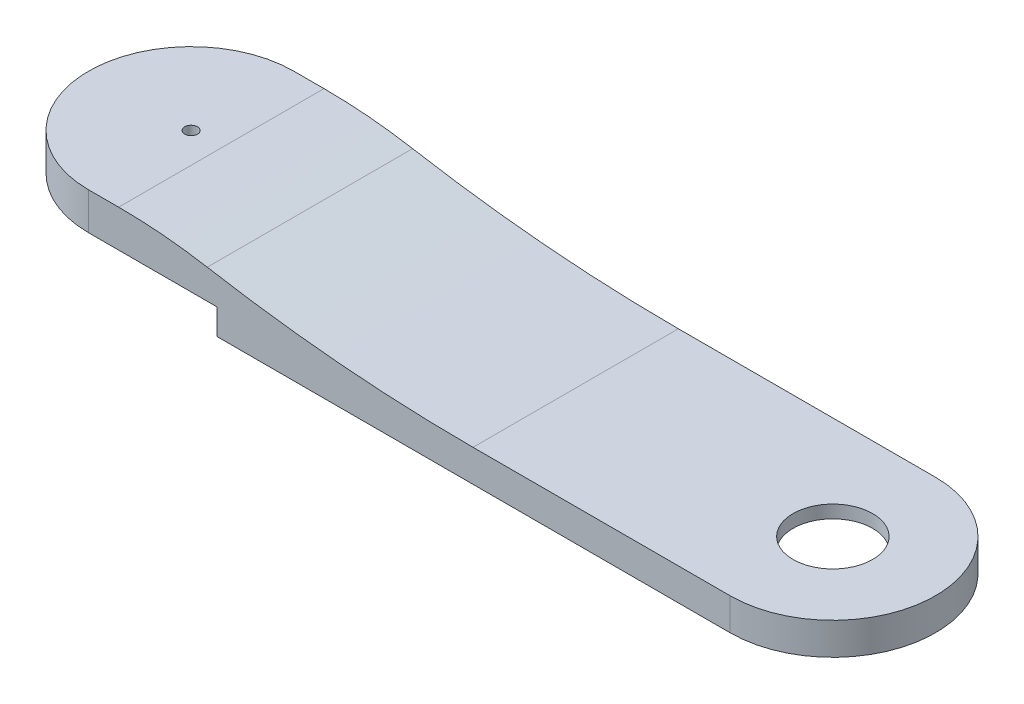
ISO-10303-21;
HEADER;
FILE_DESCRIPTION(('STEP AP214'),'2;1');
FILE_NAME('part.step','',(''),(''),'','','');
FILE_SCHEMA(('AUTOMOTIVE_DESIGN { 1 0 10303 214 1 1 1 1 }'));
ENDSEC;
DATA;
#1=APPLICATION_CONTEXT('core data for automotive mechanical design processes');
#2=APPLICATION_PROTOCOL_DEFINITION('international standard','automotive_design',2000,#1);
#3=PRODUCT_CONTEXT('',#1,'mechanical');
#4=PRODUCT('Part','Part','',(#3));
#5=PRODUCT_RELATED_PRODUCT_CATEGORY('part','',(#4));
#6=PRODUCT_DEFINITION_FORMATION('','',#4);
#7=PRODUCT_DEFINITION_CONTEXT('part definition',#1,'design');
#8=PRODUCT_DEFINITION('design','',#6,#7);
#9=PRODUCT_DEFINITION_SHAPE('','',#8);
#10=(LENGTH_UNIT() NAMED_UNIT(*) SI_UNIT(.MILLI.,.METRE.));
#11=(NAMED_UNIT(*) PLANE_ANGLE_UNIT() SI_UNIT($,.RADIAN.));
#12=(NAMED_UNIT(*) SI_UNIT($,.STERADIAN.) SOLID_ANGLE_UNIT());
#13=UNCERTAINTY_MEASURE_WITH_UNIT(LENGTH_MEASURE(1.E-05),#10,'distance_accuracy_value','');
#14=(GEOMETRIC_REPRESENTATION_CONTEXT(3) GLOBAL_UNCERTAINTY_ASSIGNED_CONTEXT((#13)) GLOBAL_UNIT_ASSIGNED_CONTEXT((#10,
#11,#12)) REPRESENTATION_CONTEXT('',''));
#15=CARTESIAN_POINT('',(0.,0.,0.));
#16=DIRECTION('',(0.,0.,1.));
#17=DIRECTION('',(1.,0.,0.));
#18=AXIS2_PLACEMENT_3D('',#15,#16,#17);
#19=CARTESIAN_POINT('',(50.,0.,0.));
#20=DIRECTION('',(-1.,0.,0.));
#21=DIRECTION('',(0.,0.,1.));
#22=AXIS2_PLACEMENT_3D('',#19,#20,#21);
#23=PLANE('',#22);
#24=DIRECTION('',(0.,-1.,0.));
#25=VECTOR('',#24,1.);
#26=CARTESIAN_POINT('',(50.,19.5,-29.));
#27=LINE('',#26,#25);
#28=CARTESIAN_POINT('',(50.,19.5,-29.));
#29=VERTEX_POINT('',#28);
#30=CARTESIAN_POINT('',(50.,10.,-29.));
#31=VERTEX_POINT('',#30);
#32=EDGE_CURVE('E221',#29,#31,#27,.T.);
#33=ORIENTED_EDGE('',*,*,#32,.T.);
#34=DIRECTION('',(0.,0.,1.));
#35=VECTOR('',#34,1.);
#36=CARTESIAN_POINT('',(50.,10.,-40.));
#37=LINE('',#36,#35);
#38=CARTESIAN_POINT('',(50.,10.,-40.));
#39=VERTEX_POINT('',#38);
#40=EDGE_CURVE('E173',#39,#31,#37,.T.);
#41=ORIENTED_EDGE('',*,*,#40,.F.);
#42=DIRECTION('',(0.,1.,0.));
#43=VECTOR('',#42,1.);
#44=CARTESIAN_POINT('',(50.,0.,-40.));
#45=LINE('',#44,#43);
#46=CARTESIAN_POINT('',(50.,0.,-40.));
#47=VERTEX_POINT('',#46);
#48=EDGE_CURVE('E170',#47,#39,#45,.T.);
#49=ORIENTED_EDGE('',*,*,#48,.F.);
#50=DIRECTION('',(0.,0.,1.));
#51=VECTOR('',#50,1.);
#52=CARTESIAN_POINT('',(50.,0.,0.));
#53=LINE('',#52,#51);
#54=CARTESIAN_POINT('',(50.,0.,-29.));
#55=VERTEX_POINT('',#54);
#56=EDGE_CURVE('E240',#47,#55,#53,.T.);
#57=ORIENTED_EDGE('',*,*,#56,.T.);
#58=DIRECTION('',(0.,-1.,0.));
#59=VECTOR('',#58,1.);
#60=CARTESIAN_POINT('',(50.,7.5,-29.));
#61=LINE('',#60,#59);
#62=CARTESIAN_POINT('',(50.,7.5,-29.));
#63=VERTEX_POINT('',#62);
#64=EDGE_CURVE('E282',#63,#55,#61,.T.);
#65=ORIENTED_EDGE('',*,*,#64,.F.);
#66=DIRECTION('',(0.,0.,1.));
#67=VECTOR('',#66,1.);
#68=CARTESIAN_POINT('',(50.,7.5,0.));
#69=LINE('',#68,#67);
#70=CARTESIAN_POINT('',(50.,7.5,29.));
#71=VERTEX_POINT('',#70);
#72=EDGE_CURVE('E231',#63,#71,#69,.T.);
#73=ORIENTED_EDGE('',*,*,#72,.T.);
#74=DIRECTION('',(0.,1.,0.));
#75=VECTOR('',#74,1.);
#76=CARTESIAN_POINT('',(50.,7.5,29.));
#77=LINE('',#76,#75);
#78=CARTESIAN_POINT('',(50.,0.,29.));
#79=VERTEX_POINT('',#78);
#80=EDGE_CURVE('E244',#79,#71,#77,.T.);
#81=ORIENTED_EDGE('',*,*,#80,.F.);
#82=CARTESIAN_POINT('',(50.,0.,40.));
#83=VERTEX_POINT('',#82);
#84=EDGE_CURVE('E237',#79,#83,#53,.T.);
#85=ORIENTED_EDGE('',*,*,#84,.T.);
#86=DIRECTION('',(0.,1.,0.));
#87=VECTOR('',#86,1.);
#88=CARTESIAN_POINT('',(50.,0.,40.));
#89=LINE('',#88,#87);
#90=CARTESIAN_POINT('',(50.,10.,40.));
#91=VERTEX_POINT('',#90);
#92=EDGE_CURVE('E242',#83,#91,#89,.T.);
#93=ORIENTED_EDGE('',*,*,#92,.T.);
#94=DIRECTION('',(0.,0.,1.));
#95=VECTOR('',#94,1.);
#96=CARTESIAN_POINT('',(50.,10.,29.));
#97=LINE('',#96,#95);
#98=CARTESIAN_POINT('',(50.,10.,29.));
#99=VERTEX_POINT('',#98);
#100=EDGE_CURVE('E197',#99,#91,#97,.T.);
#101=ORIENTED_EDGE('',*,*,#100,.F.);
#102=DIRECTION('',(0.,-1.,0.));
#103=VECTOR('',#102,1.);
#104=CARTESIAN_POINT('',(50.,19.5,29.));
#105=LINE('',#104,#103);
#106=CARTESIAN_POINT('',(50.,19.5,29.));
#107=VERTEX_POINT('',#106);
#108=EDGE_CURVE('E219',#107,#99,#105,.T.);
#109=ORIENTED_EDGE('',*,*,#108,.F.);
#110=DIRECTION('',(0.,0.,1.));
#111=VECTOR('',#110,1.);
#112=CARTESIAN_POINT('',(50.,19.5,0.));
#113=LINE('',#112,#111);
#114=EDGE_CURVE('E208',#29,#107,#113,.T.);
#115=ORIENTED_EDGE('',*,*,#114,.F.);
#116=EDGE_LOOP('',(#33,#41,#49,#57,#65,#73,#81,#85,#93,#101,#109,#115));
#117=FACE_BOUND('',#116,.T.);
#118=ADVANCED_FACE('F35',(#117),#23,.T.);
#119=CARTESIAN_POINT('',(0.,12.5,0.));
#120=DIRECTION('',(0.,1.,0.));
#121=DIRECTION('',(0.,0.,1.));
#122=AXIS2_PLACEMENT_3D('',#119,#120,#121);
#123=PLANE('',#122);
#124=CARTESIAN_POINT('',(250.,12.5,0.));
#125=DIRECTION('',(0.,-1.,0.));
#126=DIRECTION('',(0.,0.,-1.));
#127=AXIS2_PLACEMENT_3D('',#124,#125,#126);
#128=CIRCLE('',#127,15.5);
#129=CARTESIAN_POINT('',(250.,12.5,-15.5));
#130=VERTEX_POINT('',#129);
#131=EDGE_CURVE('E223',#130,#130,#128,.T.);
#132=ORIENTED_EDGE('',*,*,#131,.T.);
#133=EDGE_LOOP('',(#132));
#134=FACE_BOUND('',#133,.T.);
#135=DIRECTION('',(-1.,0.,0.));
#136=VECTOR('',#135,1.);
#137=CARTESIAN_POINT('',(0.,12.5,-40.));
#138=LINE('',#137,#136);
#139=CARTESIAN_POINT('',(250.,12.5,-40.));
#140=VERTEX_POINT('',#139);
#141=CARTESIAN_POINT('',(149.808582976972,12.5,-40.));
#142=VERTEX_POINT('',#141);
#143=EDGE_CURVE('E234',#140,#142,#138,.T.);
#144=ORIENTED_EDGE('',*,*,#143,.T.);
#145=DIRECTION('',(0.,0.,-1.));
#146=VECTOR('',#145,1.);
#147=CARTESIAN_POINT('',(149.808582976972,12.5,40.));
#148=LINE('',#147,#146);
#149=CARTESIAN_POINT('',(149.808582976972,12.5,40.));
#150=VERTEX_POINT('',#149);
#151=EDGE_CURVE('E294',#142,#150,#148,.F.);
#152=ORIENTED_EDGE('',*,*,#151,.T.);
#153=DIRECTION('',(1.,0.,0.));
#154=VECTOR('',#153,1.);
#155=CARTESIAN_POINT('',(0.,12.5,40.));
#156=LINE('',#155,#154);
#157=CARTESIAN_POINT('',(250.,12.5,40.));
#158=VERTEX_POINT('',#157);
#159=EDGE_CURVE('E228',#150,#158,#156,.T.);
#160=ORIENTED_EDGE('',*,*,#159,.T.);
#161=CARTESIAN_POINT('',(250.,12.5,0.));
#162=DIRECTION('',(0.,1.,0.));
#163=DIRECTION('',(0.,0.,1.));
#164=AXIS2_PLACEMENT_3D('',#161,#162,#163);
#165=CIRCLE('',#164,40.);
#166=EDGE_CURVE('E230',#158,#140,#165,.T.);
#167=ORIENTED_EDGE('',*,*,#166,.T.);
#168=EDGE_LOOP('',(#144,#152,#160,#167));
#169=FACE_BOUND('',#168,.T.);
#170=ADVANCED_FACE('F299',(#134,#169),#123,.T.);
#171=CARTESIAN_POINT('',(0.,0.,0.));
#172=DIRECTION('',(0.,1.,0.));
#173=DIRECTION('',(0.,0.,1.));
#174=AXIS2_PLACEMENT_3D('',#171,#172,#173);
#175=PLANE('',#174);
#176=ORIENTED_EDGE('',*,*,#56,.F.);
#177=DIRECTION('',(-1.,0.,0.));
#178=VECTOR('',#177,1.);
#179=CARTESIAN_POINT('',(0.,0.,-40.));
#180=LINE('',#179,#178);
#181=CARTESIAN_POINT('',(250.,0.,-40.));
#182=VERTEX_POINT('',#181);
#183=EDGE_CURVE('E274',#182,#47,#180,.T.);
#184=ORIENTED_EDGE('',*,*,#183,.F.);
#185=CARTESIAN_POINT('',(250.,0.,0.));
#186=DIRECTION('',(0.,1.,0.));
#187=DIRECTION('',(0.,0.,1.));
#188=AXIS2_PLACEMENT_3D('',#185,#186,#187);
#189=CIRCLE('',#188,40.);
#190=CARTESIAN_POINT('',(250.,0.,40.));
#191=VERTEX_POINT('',#190);
#192=EDGE_CURVE('E272',#191,#182,#189,.T.);
#193=ORIENTED_EDGE('',*,*,#192,.F.);
#194=DIRECTION('',(1.,0.,0.));
#195=VECTOR('',#194,1.);
#196=CARTESIAN_POINT('',(0.,0.,40.));
#197=LINE('',#196,#195);
#198=EDGE_CURVE('E270',#83,#191,#197,.T.);
#199=ORIENTED_EDGE('',*,*,#198,.F.);
#200=ORIENTED_EDGE('',*,*,#84,.F.);
#201=DIRECTION('',(1.,0.,0.));
#202=VECTOR('',#201,1.);
#203=CARTESIAN_POINT('',(0.,0.,29.));
#204=LINE('',#203,#202);
#205=CARTESIAN_POINT('',(250.,0.,29.));
#206=VERTEX_POINT('',#205);
#207=EDGE_CURVE('E248',#79,#206,#204,.T.);
#208=ORIENTED_EDGE('',*,*,#207,.T.);
#209=CARTESIAN_POINT('',(250.,0.,0.));
#210=DIRECTION('',(0.,1.,0.));
#211=DIRECTION('',(0.,0.,1.));
#212=AXIS2_PLACEMENT_3D('',#209,#210,#211);
#213=CIRCLE('',#212,29.);
#214=CARTESIAN_POINT('',(250.,0.,-29.));
#215=VERTEX_POINT('',#214);
#216=EDGE_CURVE('E261',#206,#215,#213,.T.);
#217=ORIENTED_EDGE('',*,*,#216,.T.);
#218=DIRECTION('',(-1.,0.,0.));
#219=VECTOR('',#218,1.);
#220=CARTESIAN_POINT('',(0.,0.,-29.));
#221=LINE('',#220,#219);
#222=EDGE_CURVE('E253',#215,#55,#221,.T.);
#223=ORIENTED_EDGE('',*,*,#222,.T.);
#224=EDGE_LOOP('',(#176,#184,#193,#199,#200,#208,#217,#223));
#225=FACE_BOUND('',#224,.T.);
#226=ADVANCED_FACE('F324',(#225),#175,.F.);
#227=CARTESIAN_POINT('',(0.,7.5,40.));
#228=DIRECTION('',(0.,0.,-1.));
#229=DIRECTION('',(-1.,0.,0.));
#230=AXIS2_PLACEMENT_3D('',#227,#228,#229);
#231=PLANE('',#230);
#232=ORIENTED_EDGE('',*,*,#159,.F.);
#233=CARTESIAN_POINT('',(149.808582976972,612.5,40.));
#234=DIRECTION('',(0.,0.,-1.));
#235=DIRECTION('',(-1.,0.,0.));
#236=AXIS2_PLACEMENT_3D('',#233,#234,#235);
#237=CIRCLE('',#236,600.);
#238=CARTESIAN_POINT('',(46.275979416547,21.5,40.));
#239=VERTEX_POINT('',#238);
#240=EDGE_CURVE('E43',#150,#239,#237,.T.);
#241=ORIENTED_EDGE('',*,*,#240,.T.);
#242=CARTESIAN_POINT('',(11.7651115630721,-175.5,40.));
#243=DIRECTION('',(0.,0.,-1.));
#244=DIRECTION('',(-1.,0.,0.));
#245=AXIS2_PLACEMENT_3D('',#242,#243,#244);
#246=CIRCLE('',#245,200.);
#247=CARTESIAN_POINT('',(11.7651115630721,24.5,40.));
#248=VERTEX_POINT('',#247);
#249=EDGE_CURVE('E292',#239,#248,#246,.F.);
#250=ORIENTED_EDGE('',*,*,#249,.T.);
#251=DIRECTION('',(1.,0.,0.));
#252=VECTOR('',#251,1.);
#253=CARTESIAN_POINT('',(0.,24.5,40.));
#254=LINE('',#253,#252);
#255=CARTESIAN_POINT('',(0.,24.5,40.));
#256=VERTEX_POINT('',#255);
#257=EDGE_CURVE('E200',#256,#248,#254,.T.);
#258=ORIENTED_EDGE('',*,*,#257,.F.);
#259=DIRECTION('',(0.,-1.,0.));
#260=VECTOR('',#259,1.);
#261=CARTESIAN_POINT('',(0.,19.5,40.));
#262=LINE('',#261,#260);
#263=CARTESIAN_POINT('',(0.,10.,40.));
#264=VERTEX_POINT('',#263);
#265=EDGE_CURVE('E163',#256,#264,#262,.T.);
#266=ORIENTED_EDGE('',*,*,#265,.T.);
#267=DIRECTION('',(-1.,0.,0.));
#268=VECTOR('',#267,1.);
#269=CARTESIAN_POINT('',(50.,10.,40.));
#270=LINE('',#269,#268);
#271=EDGE_CURVE('E179',#91,#264,#270,.T.);
#272=ORIENTED_EDGE('',*,*,#271,.F.);
#273=ORIENTED_EDGE('',*,*,#92,.F.);
#274=ORIENTED_EDGE('',*,*,#198,.T.);
#275=DIRECTION('',(0.,-1.,0.));
#276=VECTOR('',#275,1.);
#277=CARTESIAN_POINT('',(250.,7.5,40.));
#278=LINE('',#277,#276);
#279=EDGE_CURVE('E279',#158,#191,#278,.T.);
#280=ORIENTED_EDGE('',*,*,#279,.F.);
#281=EDGE_LOOP('',(#232,#241,#250,#258,#266,#272,#273,#274,#280));
#282=FACE_BOUND('',#281,.T.);
#283=ADVANCED_FACE('F304',(#282),#231,.F.);
#284=CARTESIAN_POINT('',(0.,7.5,-40.));
#285=DIRECTION('',(0.,0.,1.));
#286=DIRECTION('',(1.,0.,0.));
#287=AXIS2_PLACEMENT_3D('',#284,#285,#286);
#288=PLANE('',#287);
#289=DIRECTION('',(-1.,0.,0.));
#290=VECTOR('',#289,1.);
#291=CARTESIAN_POINT('',(80.,24.5,-40.));
#292=LINE('',#291,#290);
#293=CARTESIAN_POINT('',(11.7651115630721,24.5,-40.));
#294=VERTEX_POINT('',#293);
#295=CARTESIAN_POINT('',(0.,24.5,-40.));
#296=VERTEX_POINT('',#295);
#297=EDGE_CURVE('E203',#294,#296,#292,.T.);
#298=ORIENTED_EDGE('',*,*,#297,.F.);
#299=CARTESIAN_POINT('',(11.7651115630721,-175.5,-40.));
#300=DIRECTION('',(0.,0.,1.));
#301=DIRECTION('',(1.,0.,0.));
#302=AXIS2_PLACEMENT_3D('',#299,#300,#301);
#303=CIRCLE('',#302,200.);
#304=CARTESIAN_POINT('',(46.275979416547,21.5,-40.));
#305=VERTEX_POINT('',#304);
#306=EDGE_CURVE('E290',#294,#305,#303,.F.);
#307=ORIENTED_EDGE('',*,*,#306,.T.);
#308=CARTESIAN_POINT('',(149.808582976972,612.5,-40.));
#309=DIRECTION('',(0.,0.,1.));
#310=DIRECTION('',(1.,0.,0.));
#311=AXIS2_PLACEMENT_3D('',#308,#309,#310);
#312=CIRCLE('',#311,600.);
#313=EDGE_CURVE('E11',#305,#142,#312,.T.);
#314=ORIENTED_EDGE('',*,*,#313,.T.);
#315=ORIENTED_EDGE('',*,*,#143,.F.);
#316=DIRECTION('',(0.,-1.,0.));
#317=VECTOR('',#316,1.);
#318=CARTESIAN_POINT('',(250.,7.5,-40.));
#319=LINE('',#318,#317);
#320=EDGE_CURVE('E276',#140,#182,#319,.T.);
#321=ORIENTED_EDGE('',*,*,#320,.T.);
#322=ORIENTED_EDGE('',*,*,#183,.T.);
#323=ORIENTED_EDGE('',*,*,#48,.T.);
#324=DIRECTION('',(1.,0.,0.));
#325=VECTOR('',#324,1.);
#326=CARTESIAN_POINT('',(0.,10.,-40.));
#327=LINE('',#326,#325);
#328=CARTESIAN_POINT('',(0.,10.,-40.));
#329=VERTEX_POINT('',#328);
#330=EDGE_CURVE('E167',#329,#39,#327,.T.);
#331=ORIENTED_EDGE('',*,*,#330,.F.);
#332=DIRECTION('',(0.,-1.,0.));
#333=VECTOR('',#332,1.);
#334=CARTESIAN_POINT('',(0.,19.5,-40.));
#335=LINE('',#334,#333);
#336=EDGE_CURVE('E153',#296,#329,#335,.T.);
#337=ORIENTED_EDGE('',*,*,#336,.F.);
#338=EDGE_LOOP('',(#298,#307,#314,#315,#321,#322,#323,#331,#337));
#339=FACE_BOUND('',#338,.T.);
#340=ADVANCED_FACE('F168',(#339),#288,.F.);
#341=CARTESIAN_POINT('',(0.,7.5,29.));
#342=DIRECTION('',(0.,0.,-1.));
#343=DIRECTION('',(-1.,0.,0.));
#344=AXIS2_PLACEMENT_3D('',#341,#342,#343);
#345=PLANE('',#344);
#346=ORIENTED_EDGE('',*,*,#207,.F.);
#347=ORIENTED_EDGE('',*,*,#80,.T.);
#348=DIRECTION('',(1.,0.,0.));
#349=VECTOR('',#348,1.);
#350=CARTESIAN_POINT('',(0.,7.5,29.));
#351=LINE('',#350,#349);
#352=CARTESIAN_POINT('',(250.,7.5,29.));
#353=VERTEX_POINT('',#352);
#354=EDGE_CURVE('E249',#71,#353,#351,.T.);
#355=ORIENTED_EDGE('',*,*,#354,.T.);
#356=DIRECTION('',(0.,-1.,0.));
#357=VECTOR('',#356,1.);
#358=CARTESIAN_POINT('',(250.,7.5,29.));
#359=LINE('',#358,#357);
#360=EDGE_CURVE('E267',#353,#206,#359,.T.);
#361=ORIENTED_EDGE('',*,*,#360,.T.);
#362=EDGE_LOOP('',(#346,#347,#355,#361));
#363=FACE_BOUND('',#362,.T.);
#364=ADVANCED_FACE('F333',(#363),#345,.T.);
#365=CARTESIAN_POINT('',(0.,7.5,-29.));
#366=DIRECTION('',(0.,0.,1.));
#367=DIRECTION('',(1.,0.,0.));
#368=AXIS2_PLACEMENT_3D('',#365,#366,#367);
#369=PLANE('',#368);
#370=DIRECTION('',(-1.,0.,0.));
#371=VECTOR('',#370,1.);
#372=CARTESIAN_POINT('',(0.,7.5,-29.));
#373=LINE('',#372,#371);
#374=CARTESIAN_POINT('',(250.,7.5,-29.));
#375=VERTEX_POINT('',#374);
#376=EDGE_CURVE('E256',#375,#63,#373,.T.);
#377=ORIENTED_EDGE('',*,*,#376,.T.);
#378=ORIENTED_EDGE('',*,*,#64,.T.);
#379=ORIENTED_EDGE('',*,*,#222,.F.);
#380=DIRECTION('',(0.,-1.,0.));
#381=VECTOR('',#380,1.);
#382=CARTESIAN_POINT('',(250.,7.5,-29.));
#383=LINE('',#382,#381);
#384=EDGE_CURVE('E259',#375,#215,#383,.T.);
#385=ORIENTED_EDGE('',*,*,#384,.F.);
#386=EDGE_LOOP('',(#377,#378,#379,#385));
#387=FACE_BOUND('',#386,.T.);
#388=ADVANCED_FACE('F330',(#387),#369,.T.);
#389=CARTESIAN_POINT('',(250.,7.5,0.));
#390=DIRECTION('',(0.,-1.,0.));
#391=DIRECTION('',(0.,0.,-1.));
#392=AXIS2_PLACEMENT_3D('',#389,#390,#391);
#393=CYLINDRICAL_SURFACE('',#392,40.);
#394=ORIENTED_EDGE('',*,*,#192,.T.);
#395=ORIENTED_EDGE('',*,*,#320,.F.);
#396=ORIENTED_EDGE('',*,*,#166,.F.);
#397=ORIENTED_EDGE('',*,*,#279,.T.);
#398=EDGE_LOOP('',(#394,#395,#396,#397));
#399=FACE_BOUND('',#398,.T.);
#400=ADVANCED_FACE('F310',(#399),#393,.T.);
#401=CARTESIAN_POINT('',(250.,7.5,0.));
#402=DIRECTION('',(0.,-1.,0.));
#403=DIRECTION('',(0.,0.,-1.));
#404=AXIS2_PLACEMENT_3D('',#401,#402,#403);
#405=CYLINDRICAL_SURFACE('',#404,29.);
#406=ORIENTED_EDGE('',*,*,#216,.F.);
#407=ORIENTED_EDGE('',*,*,#360,.F.);
#408=CARTESIAN_POINT('',(250.,7.5,0.));
#409=DIRECTION('',(0.,1.,0.));
#410=DIRECTION('',(0.,0.,1.));
#411=AXIS2_PLACEMENT_3D('',#408,#409,#410);
#412=CIRCLE('',#411,29.);
#413=EDGE_CURVE('E252',#353,#375,#412,.T.);
#414=ORIENTED_EDGE('',*,*,#413,.T.);
#415=ORIENTED_EDGE('',*,*,#384,.T.);
#416=EDGE_LOOP('',(#406,#407,#414,#415));
#417=FACE_BOUND('',#416,.T.);
#418=ADVANCED_FACE('F335',(#417),#405,.F.);
#419=CARTESIAN_POINT('',(0.,7.5,0.));
#420=DIRECTION('',(0.,1.,0.));
#421=DIRECTION('',(0.,0.,1.));
#422=AXIS2_PLACEMENT_3D('',#419,#420,#421);
#423=PLANE('',#422);
#424=CARTESIAN_POINT('',(250.,7.5,0.));
#425=DIRECTION('',(0.,1.,0.));
#426=DIRECTION('',(0.,0.,1.));
#427=AXIS2_PLACEMENT_3D('',#424,#425,#426);
#428=CIRCLE('',#427,15.5);
#429=CARTESIAN_POINT('',(250.,7.5,15.5));
#430=VERTEX_POINT('',#429);
#431=EDGE_CURVE('E227',#430,#430,#428,.T.);
#432=ORIENTED_EDGE('',*,*,#431,.T.);
#433=EDGE_LOOP('',(#432));
#434=FACE_BOUND('',#433,.T.);
#435=ORIENTED_EDGE('',*,*,#376,.F.);
#436=ORIENTED_EDGE('',*,*,#413,.F.);
#437=ORIENTED_EDGE('',*,*,#354,.F.);
#438=ORIENTED_EDGE('',*,*,#72,.F.);
#439=EDGE_LOOP('',(#435,#436,#437,#438));
#440=FACE_BOUND('',#439,.T.);
#441=ADVANCED_FACE('F329',(#434,#440),#423,.F.);
#442=CARTESIAN_POINT('',(250.,12.5,0.));
#443=DIRECTION('',(0.,-1.,0.));
#444=DIRECTION('',(0.,0.,-1.));
#445=AXIS2_PLACEMENT_3D('',#442,#443,#444);
#446=CYLINDRICAL_SURFACE('',#445,15.5);
#447=ORIENTED_EDGE('',*,*,#131,.F.);
#448=EDGE_LOOP('',(#447));
#449=FACE_BOUND('',#448,.T.);
#450=ORIENTED_EDGE('',*,*,#431,.F.);
#451=EDGE_LOOP('',(#450));
#452=FACE_BOUND('',#451,.T.);
#453=ADVANCED_FACE('F382',(#449,#452),#446,.F.);
#454=CARTESIAN_POINT('',(0.,19.5,-29.));
#455=DIRECTION('',(0.,0.,-1.));
#456=DIRECTION('',(-1.,0.,0.));
#457=AXIS2_PLACEMENT_3D('',#454,#455,#456);
#458=PLANE('',#457);
#459=DIRECTION('',(0.,-1.,0.));
#460=VECTOR('',#459,1.);
#461=CARTESIAN_POINT('',(0.,19.5,-29.));
#462=LINE('',#461,#460);
#463=CARTESIAN_POINT('',(0.,19.5,-29.));
#464=VERTEX_POINT('',#463);
#465=CARTESIAN_POINT('',(0.,10.,-29.));
#466=VERTEX_POINT('',#465);
#467=EDGE_CURVE('E162',#464,#466,#462,.T.);
#468=ORIENTED_EDGE('',*,*,#467,.T.);
#469=DIRECTION('',(-1.,0.,0.));
#470=VECTOR('',#469,1.);
#471=CARTESIAN_POINT('',(50.,10.,-29.));
#472=LINE('',#471,#470);
#473=EDGE_CURVE('E188',#31,#466,#472,.T.);
#474=ORIENTED_EDGE('',*,*,#473,.F.);
#475=ORIENTED_EDGE('',*,*,#32,.F.);
#476=DIRECTION('',(1.,0.,0.));
#477=VECTOR('',#476,1.);
#478=CARTESIAN_POINT('',(0.,19.5,-29.));
#479=LINE('',#478,#477);
#480=EDGE_CURVE('E206',#464,#29,#479,.T.);
#481=ORIENTED_EDGE('',*,*,#480,.F.);
#482=EDGE_LOOP('',(#468,#474,#475,#481));
#483=FACE_BOUND('',#482,.T.);
#484=ADVANCED_FACE('F389',(#483),#458,.F.);
#485=CARTESIAN_POINT('',(0.,19.5,29.));
#486=DIRECTION('',(0.,0.,-1.));
#487=DIRECTION('',(-1.,0.,0.));
#488=AXIS2_PLACEMENT_3D('',#485,#486,#487);
#489=PLANE('',#488);
#490=ORIENTED_EDGE('',*,*,#108,.T.);
#491=DIRECTION('',(1.,0.,0.));
#492=VECTOR('',#491,1.);
#493=CARTESIAN_POINT('',(0.,10.,29.));
#494=LINE('',#493,#492);
#495=CARTESIAN_POINT('',(0.,10.,29.));
#496=VERTEX_POINT('',#495);
#497=EDGE_CURVE('E194',#496,#99,#494,.T.);
#498=ORIENTED_EDGE('',*,*,#497,.F.);
#499=DIRECTION('',(0.,-1.,0.));
#500=VECTOR('',#499,1.);
#501=CARTESIAN_POINT('',(0.,19.5,29.));
#502=LINE('',#501,#500);
#503=CARTESIAN_POINT('',(0.,19.5,29.));
#504=VERTEX_POINT('',#503);
#505=EDGE_CURVE('E217',#504,#496,#502,.T.);
#506=ORIENTED_EDGE('',*,*,#505,.F.);
#507=DIRECTION('',(1.,0.,0.));
#508=VECTOR('',#507,1.);
#509=CARTESIAN_POINT('',(0.,19.5,29.));
#510=LINE('',#509,#508);
#511=EDGE_CURVE('E210',#504,#107,#510,.T.);
#512=ORIENTED_EDGE('',*,*,#511,.T.);
#513=EDGE_LOOP('',(#490,#498,#506,#512));
#514=FACE_BOUND('',#513,.T.);
#515=ADVANCED_FACE('F397',(#514),#489,.T.);
#516=CARTESIAN_POINT('',(0.,19.5,0.));
#517=DIRECTION('',(0.,-1.,0.));
#518=DIRECTION('',(0.,0.,-1.));
#519=AXIS2_PLACEMENT_3D('',#516,#517,#518);
#520=CYLINDRICAL_SURFACE('',#519,40.);
#521=ORIENTED_EDGE('',*,*,#336,.T.);
#522=CARTESIAN_POINT('',(0.,10.,0.));
#523=DIRECTION('',(0.,-1.,0.));
#524=DIRECTION('',(0.,0.,-1.));
#525=AXIS2_PLACEMENT_3D('',#522,#523,#524);
#526=CIRCLE('',#525,40.);
#527=EDGE_CURVE('E157',#264,#329,#526,.T.);
#528=ORIENTED_EDGE('',*,*,#527,.F.);
#529=ORIENTED_EDGE('',*,*,#265,.F.);
#530=CARTESIAN_POINT('',(0.,24.5,0.));
#531=DIRECTION('',(0.,1.,0.));
#532=DIRECTION('',(0.,0.,1.));
#533=AXIS2_PLACEMENT_3D('',#530,#531,#532);
#534=CIRCLE('',#533,40.);
#535=EDGE_CURVE('E159',#296,#256,#534,.T.);
#536=ORIENTED_EDGE('',*,*,#535,.F.);
#537=EDGE_LOOP('',(#521,#528,#529,#536));
#538=FACE_BOUND('',#537,.T.);
#539=ADVANCED_FACE('F155',(#538),#520,.T.);
#540=CARTESIAN_POINT('',(0.,19.5,0.));
#541=DIRECTION('',(0.,-1.,0.));
#542=DIRECTION('',(0.,0.,-1.));
#543=AXIS2_PLACEMENT_3D('',#540,#541,#542);
#544=CYLINDRICAL_SURFACE('',#543,29.);
#545=ORIENTED_EDGE('',*,*,#505,.T.);
#546=CARTESIAN_POINT('',(0.,10.,0.));
#547=DIRECTION('',(0.,1.,0.));
#548=DIRECTION('',(0.,0.,-1.));
#549=AXIS2_PLACEMENT_3D('',#546,#547,#548);
#550=CIRCLE('',#549,29.);
#551=EDGE_CURVE('E191',#466,#496,#550,.T.);
#552=ORIENTED_EDGE('',*,*,#551,.F.);
#553=ORIENTED_EDGE('',*,*,#467,.F.);
#554=CARTESIAN_POINT('',(0.,19.5,0.));
#555=DIRECTION('',(0.,1.,0.));
#556=DIRECTION('',(0.,0.,1.));
#557=AXIS2_PLACEMENT_3D('',#554,#555,#556);
#558=CIRCLE('',#557,29.);
#559=EDGE_CURVE('E213',#464,#504,#558,.T.);
#560=ORIENTED_EDGE('',*,*,#559,.T.);
#561=EDGE_LOOP('',(#545,#552,#553,#560));
#562=FACE_BOUND('',#561,.T.);
#563=ADVANCED_FACE('F412',(#562),#544,.F.);
#564=CARTESIAN_POINT('',(0.,24.5,0.));
#565=DIRECTION('',(0.,1.,0.));
#566=DIRECTION('',(0.,0.,1.));
#567=AXIS2_PLACEMENT_3D('',#564,#565,#566);
#568=PLANE('',#567);
#569=CARTESIAN_POINT('',(0.,24.5,0.));
#570=DIRECTION('',(0.,-1.,0.));
#571=DIRECTION('',(0.,0.,-1.));
#572=AXIS2_PLACEMENT_3D('',#569,#570,#571);
#573=CIRCLE('',#572,2.5);
#574=CARTESIAN_POINT('',(0.,24.5,-2.5));
#575=VERTEX_POINT('',#574);
#576=EDGE_CURVE('E183',#575,#575,#573,.T.);
#577=ORIENTED_EDGE('',*,*,#576,.T.);
#578=EDGE_LOOP('',(#577));
#579=FACE_BOUND('',#578,.T.);
#580=ORIENTED_EDGE('',*,*,#257,.T.);
#581=DIRECTION('',(0.,0.,-1.));
#582=VECTOR('',#581,1.);
#583=CARTESIAN_POINT('',(11.7651115630721,24.5,-40.));
#584=LINE('',#583,#582);
#585=EDGE_CURVE('E285',#248,#294,#584,.T.);
#586=ORIENTED_EDGE('',*,*,#585,.T.);
#587=ORIENTED_EDGE('',*,*,#297,.T.);
#588=ORIENTED_EDGE('',*,*,#535,.T.);
#589=EDGE_LOOP('',(#580,#586,#587,#588));
#590=FACE_BOUND('',#589,.T.);
#591=ADVANCED_FACE('F419',(#579,#590),#568,.T.);
#592=CARTESIAN_POINT('',(0.,19.5,0.));
#593=DIRECTION('',(0.,1.,0.));
#594=DIRECTION('',(0.,0.,1.));
#595=AXIS2_PLACEMENT_3D('',#592,#593,#594);
#596=PLANE('',#595);
#597=CARTESIAN_POINT('',(0.,19.5,0.));
#598=DIRECTION('',(0.,1.,0.));
#599=DIRECTION('',(0.,0.,1.));
#600=AXIS2_PLACEMENT_3D('',#597,#598,#599);
#601=CIRCLE('',#600,2.5);
#602=CARTESIAN_POINT('',(0.,19.5,2.5));
#603=VERTEX_POINT('',#602);
#604=EDGE_CURVE('E180',#603,#603,#601,.T.);
#605=ORIENTED_EDGE('',*,*,#604,.T.);
#606=EDGE_LOOP('',(#605));
#607=FACE_BOUND('',#606,.T.);
#608=ORIENTED_EDGE('',*,*,#114,.T.);
#609=ORIENTED_EDGE('',*,*,#511,.F.);
#610=ORIENTED_EDGE('',*,*,#559,.F.);
#611=ORIENTED_EDGE('',*,*,#480,.T.);
#612=EDGE_LOOP('',(#608,#609,#610,#611));
#613=FACE_BOUND('',#612,.T.);
#614=ADVANCED_FACE('F428',(#607,#613),#596,.F.);
#615=CARTESIAN_POINT('',(0.,10.,0.));
#616=DIRECTION('',(0.,-1.,0.));
#617=DIRECTION('',(0.,0.,-1.));
#618=AXIS2_PLACEMENT_3D('',#615,#616,#617);
#619=PLANE('',#618);
#620=ORIENTED_EDGE('',*,*,#527,.T.);
#621=ORIENTED_EDGE('',*,*,#330,.T.);
#622=ORIENTED_EDGE('',*,*,#40,.T.);
#623=ORIENTED_EDGE('',*,*,#473,.T.);
#624=ORIENTED_EDGE('',*,*,#551,.T.);
#625=ORIENTED_EDGE('',*,*,#497,.T.);
#626=ORIENTED_EDGE('',*,*,#100,.T.);
#627=ORIENTED_EDGE('',*,*,#271,.T.);
#628=EDGE_LOOP('',(#620,#621,#622,#623,#624,#625,#626,#627));
#629=FACE_BOUND('',#628,.T.);
#630=ADVANCED_FACE('F176',(#629),#619,.T.);
#631=CARTESIAN_POINT('',(0.,24.5,0.));
#632=DIRECTION('',(0.,-1.,0.));
#633=DIRECTION('',(0.,0.,-1.));
#634=AXIS2_PLACEMENT_3D('',#631,#632,#633);
#635=CYLINDRICAL_SURFACE('',#634,2.5);
#636=ORIENTED_EDGE('',*,*,#576,.F.);
#637=EDGE_LOOP('',(#636));
#638=FACE_BOUND('',#637,.T.);
#639=ORIENTED_EDGE('',*,*,#604,.F.);
#640=EDGE_LOOP('',(#639));
#641=FACE_BOUND('',#640,.T.);
#642=ADVANCED_FACE('F317',(#638,#641),#635,.F.);
#643=CARTESIAN_POINT('',(11.7651115630721,-175.5,0.));
#644=DIRECTION('',(0.,0.,1.));
#645=DIRECTION('',(1.,0.,0.));
#646=AXIS2_PLACEMENT_3D('',#643,#644,#645);
#647=CYLINDRICAL_SURFACE('',#646,200.);
#648=ORIENTED_EDGE('',*,*,#249,.F.);
#649=DIRECTION('',(0.,0.,1.));
#650=VECTOR('',#649,1.);
#651=CARTESIAN_POINT('',(46.275979416547,21.5,0.));
#652=LINE('',#651,#650);
#653=EDGE_CURVE('E50',#239,#305,#652,.F.);
#654=ORIENTED_EDGE('',*,*,#653,.T.);
#655=ORIENTED_EDGE('',*,*,#306,.F.);
#656=ORIENTED_EDGE('',*,*,#585,.F.);
#657=EDGE_LOOP('',(#648,#654,#655,#656));
#658=FACE_BOUND('',#657,.T.);
#659=ADVANCED_FACE('F313',(#658),#647,.T.);
#660=CARTESIAN_POINT('',(149.808582976972,612.5,0.));
#661=DIRECTION('',(0.,0.,1.));
#662=DIRECTION('',(1.,0.,0.));
#663=AXIS2_PLACEMENT_3D('',#660,#661,#662);
#664=CYLINDRICAL_SURFACE('',#663,600.);
#665=ORIENTED_EDGE('',*,*,#313,.F.);
#666=ORIENTED_EDGE('',*,*,#653,.F.);
#667=ORIENTED_EDGE('',*,*,#240,.F.);
#668=ORIENTED_EDGE('',*,*,#151,.F.);
#669=EDGE_LOOP('',(#665,#666,#667,#668));
#670=FACE_BOUND('',#669,.T.);
#671=ADVANCED_FACE('F37',(#670),#664,.F.);
#672=CLOSED_SHELL('',(#118,#170,#226,#283,#340,#364,#388,#400,#418,#441,#453,#484,#515,#539,
#563,#591,#614,#630,#642,#659,#671));
#673=MANIFOLD_SOLID_BREP('B2',#672);
#674=ADVANCED_BREP_SHAPE_REPRESENTATION('',(#18,#673),#14);
#675=SHAPE_DEFINITION_REPRESENTATION(#9,#674);
ENDSEC;
END-ISO-10303-21;
